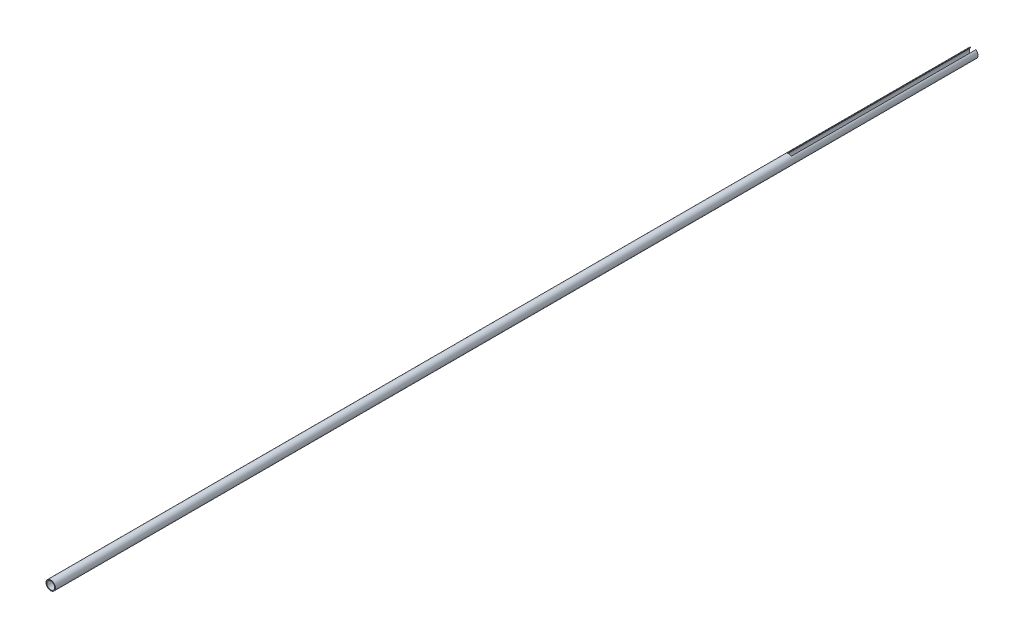
ISO-10303-21;
HEADER;
FILE_DESCRIPTION(('STEP AP214'),'2;1');
FILE_NAME('part.step','',(''),(''),'','','');
FILE_SCHEMA(('AUTOMOTIVE_DESIGN { 1 0 10303 214 1 1 1 1 }'));
ENDSEC;
DATA;
#1=APPLICATION_CONTEXT('core data for automotive mechanical design processes');
#2=APPLICATION_PROTOCOL_DEFINITION('international standard','automotive_design',2000,#1);
#3=PRODUCT_CONTEXT('',#1,'mechanical');
#4=PRODUCT('Part','Part','',(#3));
#5=PRODUCT_RELATED_PRODUCT_CATEGORY('part','',(#4));
#6=PRODUCT_DEFINITION_FORMATION('','',#4);
#7=PRODUCT_DEFINITION_CONTEXT('part definition',#1,'design');
#8=PRODUCT_DEFINITION('design','',#6,#7);
#9=PRODUCT_DEFINITION_SHAPE('','',#8);
#10=(LENGTH_UNIT() NAMED_UNIT(*) SI_UNIT(.MILLI.,.METRE.));
#11=(NAMED_UNIT(*) PLANE_ANGLE_UNIT() SI_UNIT($,.RADIAN.));
#12=(NAMED_UNIT(*) SI_UNIT($,.STERADIAN.) SOLID_ANGLE_UNIT());
#13=UNCERTAINTY_MEASURE_WITH_UNIT(LENGTH_MEASURE(1.E-05),#10,'distance_accuracy_value','');
#14=(GEOMETRIC_REPRESENTATION_CONTEXT(3) GLOBAL_UNCERTAINTY_ASSIGNED_CONTEXT((#13)) GLOBAL_UNIT_ASSIGNED_CONTEXT((#10,
#11,#12)) REPRESENTATION_CONTEXT('',''));
#15=CARTESIAN_POINT('',(0.,0.,0.));
#16=DIRECTION('',(0.,0.,1.));
#17=DIRECTION('',(1.,0.,0.));
#18=AXIS2_PLACEMENT_3D('',#15,#16,#17);
#19=CARTESIAN_POINT('',(0.,0.,0.));
#20=DIRECTION('',(0.,0.,1.));
#21=DIRECTION('',(1.,0.,0.));
#22=AXIS2_PLACEMENT_3D('',#19,#20,#21);
#23=PLANE('',#22);
#24=DIRECTION('',(0.,-1.,0.));
#25=VECTOR('',#24,1.);
#26=CARTESIAN_POINT('',(-0.35,0.0999999999999999,0.));
#27=LINE('',#26,#25);
#28=CARTESIAN_POINT('',(-0.35,0.529834879939024,0.));
#29=VERTEX_POINT('',#28);
#30=CARTESIAN_POINT('',(-0.35,0.402511565051242,0.));
#31=VERTEX_POINT('',#30);
#32=EDGE_CURVE('E72',#29,#31,#27,.T.);
#33=ORIENTED_EDGE('',*,*,#32,.T.);
#34=CARTESIAN_POINT('',(0.,0.,0.));
#35=DIRECTION('',(0.,0.,1.));
#36=DIRECTION('',(1.,0.,0.));
#37=AXIS2_PLACEMENT_3D('',#34,#35,#36);
#38=CIRCLE('',#37,0.5334);
#39=CARTESIAN_POINT('',(0.35,0.402511565051242,0.));
#40=VERTEX_POINT('',#39);
#41=EDGE_CURVE('E87',#31,#40,#38,.T.);
#42=ORIENTED_EDGE('',*,*,#41,.T.);
#43=DIRECTION('',(0.,1.,0.));
#44=VECTOR('',#43,1.);
#45=CARTESIAN_POINT('',(0.35,0.1,0.));
#46=LINE('',#45,#44);
#47=CARTESIAN_POINT('',(0.35,0.529834879939024,0.));
#48=VERTEX_POINT('',#47);
#49=EDGE_CURVE('E81',#40,#48,#46,.T.);
#50=ORIENTED_EDGE('',*,*,#49,.T.);
#51=CARTESIAN_POINT('',(0.,0.,0.));
#52=DIRECTION('',(0.,0.,1.));
#53=DIRECTION('',(1.,0.,0.));
#54=AXIS2_PLACEMENT_3D('',#51,#52,#53);
#55=CIRCLE('',#54,0.635);
#56=EDGE_CURVE('E86',#29,#48,#55,.T.);
#57=ORIENTED_EDGE('',*,*,#56,.F.);
#58=EDGE_LOOP('',(#33,#42,#50,#57));
#59=FACE_BOUND('',#58,.T.);
#60=ADVANCED_FACE('F33',(#59),#23,.F.);
#61=CARTESIAN_POINT('',(0.,0.,125.));
#62=DIRECTION('',(0.,0.,-1.));
#63=DIRECTION('',(-1.,0.,0.));
#64=AXIS2_PLACEMENT_3D('',#61,#62,#63);
#65=CYLINDRICAL_SURFACE('',#64,0.635);
#66=CARTESIAN_POINT('',(0.,0.,125.));
#67=DIRECTION('',(0.,0.,1.));
#68=DIRECTION('',(1.,0.,0.));
#69=AXIS2_PLACEMENT_3D('',#66,#67,#68);
#70=CIRCLE('',#69,0.635);
#71=CARTESIAN_POINT('',(0.635,0.,125.));
#72=VERTEX_POINT('',#71);
#73=EDGE_CURVE('E91',#72,#72,#70,.T.);
#74=ORIENTED_EDGE('',*,*,#73,.F.);
#75=EDGE_LOOP('',(#74));
#76=FACE_BOUND('',#75,.T.);
#77=DIRECTION('',(0.,0.,-1.));
#78=VECTOR('',#77,1.);
#79=CARTESIAN_POINT('',(-0.35,0.529834879939024,125.));
#80=LINE('',#79,#78);
#81=CARTESIAN_POINT('',(-0.35,0.529834879939024,25.));
#82=VERTEX_POINT('',#81);
#83=EDGE_CURVE('E76',#29,#82,#80,.F.);
#84=ORIENTED_EDGE('',*,*,#83,.F.);
#85=ORIENTED_EDGE('',*,*,#56,.T.);
#86=DIRECTION('',(0.,0.,-1.));
#87=VECTOR('',#86,1.);
#88=CARTESIAN_POINT('',(0.35,0.529834879939024,125.));
#89=LINE('',#88,#87);
#90=CARTESIAN_POINT('',(0.35,0.529834879939024,25.));
#91=VERTEX_POINT('',#90);
#92=EDGE_CURVE('E88',#91,#48,#89,.T.);
#93=ORIENTED_EDGE('',*,*,#92,.F.);
#94=CARTESIAN_POINT('',(0.,0.,25.));
#95=DIRECTION('',(0.,0.,1.));
#96=DIRECTION('',(1.,0.,0.));
#97=AXIS2_PLACEMENT_3D('',#94,#95,#96);
#98=CIRCLE('',#97,0.635);
#99=EDGE_CURVE('E53',#91,#82,#98,.T.);
#100=ORIENTED_EDGE('',*,*,#99,.T.);
#101=EDGE_LOOP('',(#84,#85,#93,#100));
#102=FACE_BOUND('',#101,.T.);
#103=ADVANCED_FACE('F35',(#76,#102),#65,.T.);
#104=CARTESIAN_POINT('',(0.,0.,125.));
#105=DIRECTION('',(0.,0.,-1.));
#106=DIRECTION('',(-1.,0.,0.));
#107=AXIS2_PLACEMENT_3D('',#104,#105,#106);
#108=CYLINDRICAL_SURFACE('',#107,0.5334);
#109=CARTESIAN_POINT('',(0.,0.,125.));
#110=DIRECTION('',(0.,0.,1.));
#111=DIRECTION('',(1.,0.,0.));
#112=AXIS2_PLACEMENT_3D('',#109,#110,#111);
#113=CIRCLE('',#112,0.5334);
#114=CARTESIAN_POINT('',(0.5334,0.,125.));
#115=VERTEX_POINT('',#114);
#116=EDGE_CURVE('E92',#115,#115,#113,.T.);
#117=ORIENTED_EDGE('',*,*,#116,.T.);
#118=EDGE_LOOP('',(#117));
#119=FACE_BOUND('',#118,.T.);
#120=ORIENTED_EDGE('',*,*,#41,.F.);
#121=DIRECTION('',(0.,0.,-1.));
#122=VECTOR('',#121,1.);
#123=CARTESIAN_POINT('',(-0.35,0.402511565051242,125.));
#124=LINE('',#123,#122);
#125=CARTESIAN_POINT('',(-0.35,0.402511565051242,25.));
#126=VERTEX_POINT('',#125);
#127=EDGE_CURVE('E11',#31,#126,#124,.F.);
#128=ORIENTED_EDGE('',*,*,#127,.T.);
#129=CARTESIAN_POINT('',(0.,0.,25.));
#130=DIRECTION('',(0.,0.,1.));
#131=DIRECTION('',(1.,0.,0.));
#132=AXIS2_PLACEMENT_3D('',#129,#130,#131);
#133=CIRCLE('',#132,0.5334);
#134=CARTESIAN_POINT('',(0.35,0.402511565051242,25.));
#135=VERTEX_POINT('',#134);
#136=EDGE_CURVE('E95',#135,#126,#133,.T.);
#137=ORIENTED_EDGE('',*,*,#136,.F.);
#138=DIRECTION('',(0.,0.,-1.));
#139=VECTOR('',#138,1.);
#140=CARTESIAN_POINT('',(0.35,0.402511565051242,125.));
#141=LINE('',#140,#139);
#142=EDGE_CURVE('E41',#135,#40,#141,.T.);
#143=ORIENTED_EDGE('',*,*,#142,.T.);
#144=EDGE_LOOP('',(#120,#128,#137,#143));
#145=FACE_BOUND('',#144,.T.);
#146=ADVANCED_FACE('F104',(#119,#145),#108,.F.);
#147=CARTESIAN_POINT('',(0.,0.,125.));
#148=DIRECTION('',(0.,0.,1.));
#149=DIRECTION('',(1.,0.,0.));
#150=AXIS2_PLACEMENT_3D('',#147,#148,#149);
#151=PLANE('',#150);
#152=ORIENTED_EDGE('',*,*,#73,.T.);
#153=EDGE_LOOP('',(#152));
#154=FACE_BOUND('',#153,.T.);
#155=ORIENTED_EDGE('',*,*,#116,.F.);
#156=EDGE_LOOP('',(#155));
#157=FACE_BOUND('',#156,.T.);
#158=ADVANCED_FACE('F126',(#154,#157),#151,.T.);
#159=CARTESIAN_POINT('',(-0.35,0.0999999999999999,25.));
#160=DIRECTION('',(1.,0.,0.));
#161=DIRECTION('',(0.,1.,0.));
#162=AXIS2_PLACEMENT_3D('',#159,#160,#161);
#163=PLANE('',#162);
#164=ORIENTED_EDGE('',*,*,#83,.T.);
#165=DIRECTION('',(0.,-1.,0.));
#166=VECTOR('',#165,1.);
#167=CARTESIAN_POINT('',(-0.35,0.0999999999999999,25.));
#168=LINE('',#167,#166);
#169=EDGE_CURVE('E109',#82,#126,#168,.T.);
#170=ORIENTED_EDGE('',*,*,#169,.T.);
#171=ORIENTED_EDGE('',*,*,#127,.F.);
#172=ORIENTED_EDGE('',*,*,#32,.F.);
#173=EDGE_LOOP('',(#164,#170,#171,#172));
#174=FACE_BOUND('',#173,.T.);
#175=ADVANCED_FACE('F74',(#174),#163,.T.);
#176=CARTESIAN_POINT('',(0.35,0.1,25.));
#177=DIRECTION('',(-1.,0.,0.));
#178=DIRECTION('',(0.,-1.,0.));
#179=AXIS2_PLACEMENT_3D('',#176,#177,#178);
#180=PLANE('',#179);
#181=ORIENTED_EDGE('',*,*,#92,.T.);
#182=ORIENTED_EDGE('',*,*,#49,.F.);
#183=ORIENTED_EDGE('',*,*,#142,.F.);
#184=DIRECTION('',(0.,1.,0.));
#185=VECTOR('',#184,1.);
#186=CARTESIAN_POINT('',(0.35,0.1,25.));
#187=LINE('',#186,#185);
#188=EDGE_CURVE('E48',#135,#91,#187,.T.);
#189=ORIENTED_EDGE('',*,*,#188,.T.);
#190=EDGE_LOOP('',(#181,#182,#183,#189));
#191=FACE_BOUND('',#190,.T.);
#192=ADVANCED_FACE('F114',(#191),#180,.T.);
#193=CARTESIAN_POINT('',(0.,0.,25.));
#194=DIRECTION('',(0.,0.,1.));
#195=DIRECTION('',(1.,0.,0.));
#196=AXIS2_PLACEMENT_3D('',#193,#194,#195);
#197=PLANE('',#196);
#198=ORIENTED_EDGE('',*,*,#188,.F.);
#199=ORIENTED_EDGE('',*,*,#136,.T.);
#200=ORIENTED_EDGE('',*,*,#169,.F.);
#201=ORIENTED_EDGE('',*,*,#99,.F.);
#202=EDGE_LOOP('',(#198,#199,#200,#201));
#203=FACE_BOUND('',#202,.T.);
#204=ADVANCED_FACE('F112',(#203),#197,.F.);
#205=CLOSED_SHELL('',(#60,#103,#146,#158,#175,#192,#204));
#206=MANIFOLD_SOLID_BREP('B2',#205);
#207=ADVANCED_BREP_SHAPE_REPRESENTATION('',(#18,#206),#14);
#208=SHAPE_DEFINITION_REPRESENTATION(#9,#207);
ENDSEC;
END-ISO-10303-21;
